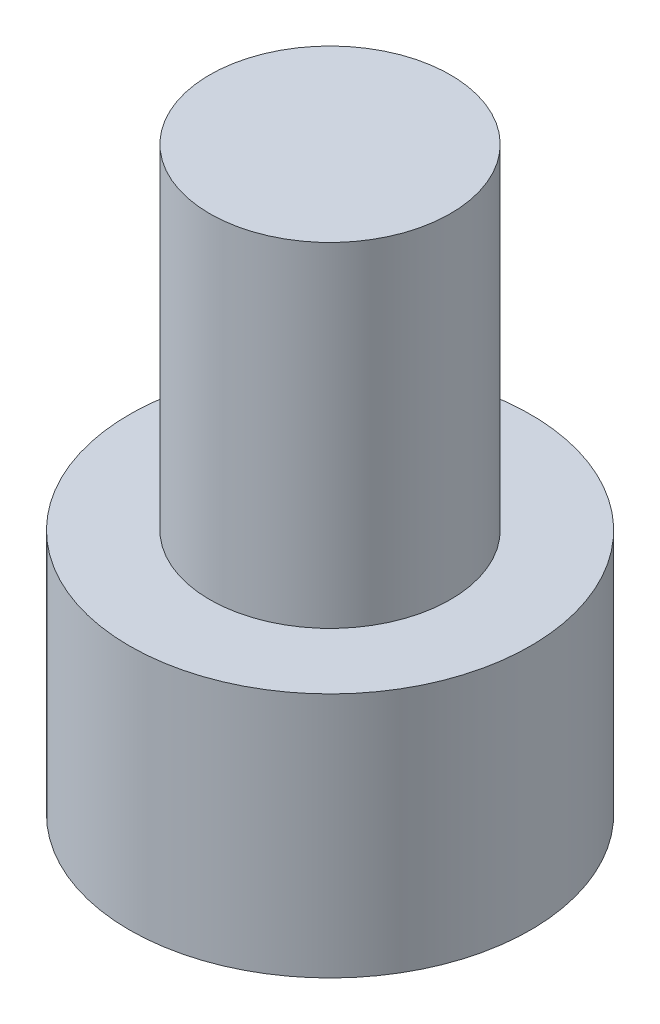
ISO-10303-21;
HEADER;
FILE_DESCRIPTION(('STEP AP214'),'2;1');
FILE_NAME('part.step','',(''),(''),'','','');
FILE_SCHEMA(('AUTOMOTIVE_DESIGN { 1 0 10303 214 1 1 1 1 }'));
ENDSEC;
DATA;
#1=APPLICATION_CONTEXT('core data for automotive mechanical design processes');
#2=APPLICATION_PROTOCOL_DEFINITION('international standard','automotive_design',2000,#1);
#3=PRODUCT_CONTEXT('',#1,'mechanical');
#4=PRODUCT('Part','Part','',(#3));
#5=PRODUCT_RELATED_PRODUCT_CATEGORY('part','',(#4));
#6=PRODUCT_DEFINITION_FORMATION('','',#4);
#7=PRODUCT_DEFINITION_CONTEXT('part definition',#1,'design');
#8=PRODUCT_DEFINITION('design','',#6,#7);
#9=PRODUCT_DEFINITION_SHAPE('','',#8);
#10=(LENGTH_UNIT() NAMED_UNIT(*) SI_UNIT(.MILLI.,.METRE.));
#11=(NAMED_UNIT(*) PLANE_ANGLE_UNIT() SI_UNIT($,.RADIAN.));
#12=(NAMED_UNIT(*) SI_UNIT($,.STERADIAN.) SOLID_ANGLE_UNIT());
#13=UNCERTAINTY_MEASURE_WITH_UNIT(LENGTH_MEASURE(1.E-05),#10,'distance_accuracy_value','');
#14=(GEOMETRIC_REPRESENTATION_CONTEXT(3) GLOBAL_UNCERTAINTY_ASSIGNED_CONTEXT((#13)) GLOBAL_UNIT_ASSIGNED_CONTEXT((#10,
#11,#12)) REPRESENTATION_CONTEXT('',''));
#15=CARTESIAN_POINT('',(0.,0.,0.));
#16=DIRECTION('',(0.,0.,1.));
#17=DIRECTION('',(1.,0.,0.));
#18=AXIS2_PLACEMENT_3D('',#15,#16,#17);
#19=CARTESIAN_POINT('',(0.,3.5052,0.));
#20=DIRECTION('',(0.,1.,0.));
#21=DIRECTION('',(0.,0.,1.));
#22=AXIS2_PLACEMENT_3D('',#19,#20,#21);
#23=PLANE('',#22);
#24=CARTESIAN_POINT('',(0.,3.5052,0.));
#25=DIRECTION('',(0.,1.,0.));
#26=DIRECTION('',(0.,0.,1.));
#27=AXIS2_PLACEMENT_3D('',#24,#25,#26);
#28=CIRCLE('',#27,2.8575);
#29=CARTESIAN_POINT('',(0.,3.5052,2.8575));
#30=VERTEX_POINT('',#29);
#31=EDGE_CURVE('E11',#30,#30,#28,.T.);
#32=ORIENTED_EDGE('',*,*,#31,.T.);
#33=EDGE_LOOP('',(#32));
#34=FACE_BOUND('',#33,.T.);
#35=CARTESIAN_POINT('',(0.,3.5052,0.));
#36=DIRECTION('',(0.,1.,0.));
#37=DIRECTION('',(0.,0.,1.));
#38=AXIS2_PLACEMENT_3D('',#35,#36,#37);
#39=CIRCLE('',#38,1.7145);
#40=CARTESIAN_POINT('',(0.,3.5052,1.7145));
#41=VERTEX_POINT('',#40);
#42=EDGE_CURVE('E152',#41,#41,#39,.T.);
#43=ORIENTED_EDGE('',*,*,#42,.F.);
#44=EDGE_LOOP('',(#43));
#45=FACE_BOUND('',#44,.T.);
#46=ADVANCED_FACE('F33',(#34,#45),#23,.T.);
#47=CARTESIAN_POINT('',(0.,3.5052,0.));
#48=DIRECTION('',(0.,-1.,0.));
#49=DIRECTION('',(0.,0.,-1.));
#50=AXIS2_PLACEMENT_3D('',#47,#48,#49);
#51=CYLINDRICAL_SURFACE('',#50,2.8575);
#52=ORIENTED_EDGE('',*,*,#31,.F.);
#53=EDGE_LOOP('',(#52));
#54=FACE_BOUND('',#53,.T.);
#55=CARTESIAN_POINT('',(0.,0.,0.));
#56=DIRECTION('',(0.,1.,0.));
#57=DIRECTION('',(0.,0.,1.));
#58=AXIS2_PLACEMENT_3D('',#55,#56,#57);
#59=CIRCLE('',#58,2.8575);
#60=CARTESIAN_POINT('',(0.,0.,2.8575));
#61=VERTEX_POINT('',#60);
#62=EDGE_CURVE('E37',#61,#61,#59,.T.);
#63=ORIENTED_EDGE('',*,*,#62,.T.);
#64=EDGE_LOOP('',(#63));
#65=FACE_BOUND('',#64,.T.);
#66=ADVANCED_FACE('F35',(#54,#65),#51,.T.);
#67=CARTESIAN_POINT('',(0.,0.,0.));
#68=DIRECTION('',(0.,1.,0.));
#69=DIRECTION('',(0.,0.,1.));
#70=AXIS2_PLACEMENT_3D('',#67,#68,#69);
#71=PLANE('',#70);
#72=DIRECTION('',(-0.500000000000001,0.,0.866025403784438));
#73=VECTOR('',#72,1.);
#74=CARTESIAN_POINT('',(1.60395121659243,0.,0.));
#75=LINE('',#74,#73);
#76=CARTESIAN_POINT('',(1.60395121659243,0.,0.));
#77=VERTEX_POINT('',#76);
#78=CARTESIAN_POINT('',(0.801975608296214,0.,1.3890625));
#79=VERTEX_POINT('',#78);
#80=EDGE_CURVE('E122',#77,#79,#75,.T.);
#81=ORIENTED_EDGE('',*,*,#80,.F.);
#82=DIRECTION('',(0.5,0.,0.866025403784439));
#83=VECTOR('',#82,1.);
#84=CARTESIAN_POINT('',(0.801975608296215,0.,-1.3890625));
#85=LINE('',#84,#83);
#86=CARTESIAN_POINT('',(0.801975608296215,0.,-1.3890625));
#87=VERTEX_POINT('',#86);
#88=EDGE_CURVE('E48',#87,#77,#85,.T.);
#89=ORIENTED_EDGE('',*,*,#88,.F.);
#90=DIRECTION('',(1.,0.,0.));
#91=VECTOR('',#90,1.);
#92=CARTESIAN_POINT('',(-0.801975608296214,0.,-1.3890625));
#93=LINE('',#92,#91);
#94=CARTESIAN_POINT('',(-0.801975608296214,0.,-1.3890625));
#95=VERTEX_POINT('',#94);
#96=EDGE_CURVE('E132',#95,#87,#93,.T.);
#97=ORIENTED_EDGE('',*,*,#96,.F.);
#98=DIRECTION('',(0.5,0.,-0.866025403784438));
#99=VECTOR('',#98,1.);
#100=CARTESIAN_POINT('',(-1.60395121659243,0.,0.));
#101=LINE('',#100,#99);
#102=CARTESIAN_POINT('',(-1.60395121659243,0.,0.));
#103=VERTEX_POINT('',#102);
#104=EDGE_CURVE('E130',#103,#95,#101,.T.);
#105=ORIENTED_EDGE('',*,*,#104,.F.);
#106=DIRECTION('',(-0.5,0.,-0.866025403784439));
#107=VECTOR('',#106,1.);
#108=CARTESIAN_POINT('',(-0.801975608296214,0.,1.3890625));
#109=LINE('',#108,#107);
#110=CARTESIAN_POINT('',(-0.801975608296214,0.,1.3890625));
#111=VERTEX_POINT('',#110);
#112=EDGE_CURVE('E96',#111,#103,#109,.T.);
#113=ORIENTED_EDGE('',*,*,#112,.F.);
#114=DIRECTION('',(-1.,0.,0.));
#115=VECTOR('',#114,1.);
#116=CARTESIAN_POINT('',(0.801975608296214,0.,1.3890625));
#117=LINE('',#116,#115);
#118=EDGE_CURVE('E126',#79,#111,#117,.T.);
#119=ORIENTED_EDGE('',*,*,#118,.F.);
#120=EDGE_LOOP('',(#81,#89,#97,#105,#113,#119));
#121=FACE_BOUND('',#120,.T.);
#122=ORIENTED_EDGE('',*,*,#62,.F.);
#123=EDGE_LOOP('',(#122));
#124=FACE_BOUND('',#123,.T.);
#125=ADVANCED_FACE('F145',(#121,#124),#71,.F.);
#126=CARTESIAN_POINT('',(0.801975608296215,1.9558,-1.3890625));
#127=DIRECTION('',(0.866025403784438,0.,-0.5));
#128=DIRECTION('',(-0.5,0.,-0.866025403784439));
#129=AXIS2_PLACEMENT_3D('',#126,#127,#128);
#130=PLANE('',#129);
#131=ORIENTED_EDGE('',*,*,#88,.T.);
#132=DIRECTION('',(0.,-1.,0.));
#133=VECTOR('',#132,1.);
#134=CARTESIAN_POINT('',(1.60395121659243,1.9558,0.));
#135=LINE('',#134,#133);
#136=CARTESIAN_POINT('',(1.60395121659243,1.9558,0.));
#137=VERTEX_POINT('',#136);
#138=EDGE_CURVE('E78',#137,#77,#135,.T.);
#139=ORIENTED_EDGE('',*,*,#138,.F.);
#140=DIRECTION('',(0.5,0.,0.866025403784439));
#141=VECTOR('',#140,1.);
#142=CARTESIAN_POINT('',(0.801975608296215,1.9558,-1.3890625));
#143=LINE('',#142,#141);
#144=CARTESIAN_POINT('',(0.801975608296215,1.9558,-1.3890625));
#145=VERTEX_POINT('',#144);
#146=EDGE_CURVE('E134',#145,#137,#143,.T.);
#147=ORIENTED_EDGE('',*,*,#146,.F.);
#148=DIRECTION('',(0.,-1.,0.));
#149=VECTOR('',#148,1.);
#150=CARTESIAN_POINT('',(0.801975608296215,1.9558,-1.3890625));
#151=LINE('',#150,#149);
#152=EDGE_CURVE('E56',#145,#87,#151,.T.);
#153=ORIENTED_EDGE('',*,*,#152,.T.);
#154=EDGE_LOOP('',(#131,#139,#147,#153));
#155=FACE_BOUND('',#154,.T.);
#156=ADVANCED_FACE('F174',(#155),#130,.F.);
#157=CARTESIAN_POINT('',(-0.801975608296214,1.9558,-1.3890625));
#158=DIRECTION('',(0.,0.,-1.));
#159=DIRECTION('',(-1.,0.,0.));
#160=AXIS2_PLACEMENT_3D('',#157,#158,#159);
#161=PLANE('',#160);
#162=ORIENTED_EDGE('',*,*,#96,.T.);
#163=ORIENTED_EDGE('',*,*,#152,.F.);
#164=DIRECTION('',(1.,0.,0.));
#165=VECTOR('',#164,1.);
#166=CARTESIAN_POINT('',(-0.801975608296214,1.9558,-1.3890625));
#167=LINE('',#166,#165);
#168=CARTESIAN_POINT('',(-0.801975608296214,1.9558,-1.3890625));
#169=VERTEX_POINT('',#168);
#170=EDGE_CURVE('E108',#169,#145,#167,.T.);
#171=ORIENTED_EDGE('',*,*,#170,.F.);
#172=DIRECTION('',(0.,-1.,0.));
#173=VECTOR('',#172,1.);
#174=CARTESIAN_POINT('',(-0.801975608296214,1.9558,-1.3890625));
#175=LINE('',#174,#173);
#176=EDGE_CURVE('E100',#169,#95,#175,.T.);
#177=ORIENTED_EDGE('',*,*,#176,.T.);
#178=EDGE_LOOP('',(#162,#163,#171,#177));
#179=FACE_BOUND('',#178,.T.);
#180=ADVANCED_FACE('F180',(#179),#161,.F.);
#181=CARTESIAN_POINT('',(-1.60395121659243,1.9558,0.));
#182=DIRECTION('',(-0.866025403784438,0.,-0.5));
#183=DIRECTION('',(-0.5,0.,0.866025403784439));
#184=AXIS2_PLACEMENT_3D('',#181,#182,#183);
#185=PLANE('',#184);
#186=ORIENTED_EDGE('',*,*,#104,.T.);
#187=ORIENTED_EDGE('',*,*,#176,.F.);
#188=DIRECTION('',(0.5,0.,-0.866025403784438));
#189=VECTOR('',#188,1.);
#190=CARTESIAN_POINT('',(-1.60395121659243,1.9558,0.));
#191=LINE('',#190,#189);
#192=CARTESIAN_POINT('',(-1.60395121659243,1.9558,0.));
#193=VERTEX_POINT('',#192);
#194=EDGE_CURVE('E104',#193,#169,#191,.T.);
#195=ORIENTED_EDGE('',*,*,#194,.F.);
#196=DIRECTION('',(0.,-1.,0.));
#197=VECTOR('',#196,1.);
#198=CARTESIAN_POINT('',(-1.60395121659243,1.9558,0.));
#199=LINE('',#198,#197);
#200=EDGE_CURVE('E89',#193,#103,#199,.T.);
#201=ORIENTED_EDGE('',*,*,#200,.T.);
#202=EDGE_LOOP('',(#186,#187,#195,#201));
#203=FACE_BOUND('',#202,.T.);
#204=ADVANCED_FACE('F105',(#203),#185,.F.);
#205=CARTESIAN_POINT('',(-0.801975608296214,1.9558,1.3890625));
#206=DIRECTION('',(-0.866025403784439,0.,0.5));
#207=DIRECTION('',(0.5,0.,0.866025403784439));
#208=AXIS2_PLACEMENT_3D('',#205,#206,#207);
#209=PLANE('',#208);
#210=ORIENTED_EDGE('',*,*,#112,.T.);
#211=ORIENTED_EDGE('',*,*,#200,.F.);
#212=DIRECTION('',(-0.5,0.,-0.866025403784439));
#213=VECTOR('',#212,1.);
#214=CARTESIAN_POINT('',(-0.801975608296214,1.9558,1.3890625));
#215=LINE('',#214,#213);
#216=CARTESIAN_POINT('',(-0.801975608296214,1.9558,1.3890625));
#217=VERTEX_POINT('',#216);
#218=EDGE_CURVE('E93',#217,#193,#215,.T.);
#219=ORIENTED_EDGE('',*,*,#218,.F.);
#220=DIRECTION('',(0.,-1.,0.));
#221=VECTOR('',#220,1.);
#222=CARTESIAN_POINT('',(-0.801975608296214,1.9558,1.3890625));
#223=LINE('',#222,#221);
#224=EDGE_CURVE('E101',#217,#111,#223,.T.);
#225=ORIENTED_EDGE('',*,*,#224,.T.);
#226=EDGE_LOOP('',(#210,#211,#219,#225));
#227=FACE_BOUND('',#226,.T.);
#228=ADVANCED_FACE('F91',(#227),#209,.F.);
#229=CARTESIAN_POINT('',(0.801975608296214,1.9558,1.3890625));
#230=DIRECTION('',(0.,0.,1.));
#231=DIRECTION('',(1.,0.,0.));
#232=AXIS2_PLACEMENT_3D('',#229,#230,#231);
#233=PLANE('',#232);
#234=ORIENTED_EDGE('',*,*,#118,.T.);
#235=ORIENTED_EDGE('',*,*,#224,.F.);
#236=DIRECTION('',(-1.,0.,0.));
#237=VECTOR('',#236,1.);
#238=CARTESIAN_POINT('',(0.801975608296214,1.9558,1.3890625));
#239=LINE('',#238,#237);
#240=CARTESIAN_POINT('',(0.801975608296214,1.9558,1.3890625));
#241=VERTEX_POINT('',#240);
#242=EDGE_CURVE('E114',#241,#217,#239,.T.);
#243=ORIENTED_EDGE('',*,*,#242,.F.);
#244=DIRECTION('',(0.,-1.,0.));
#245=VECTOR('',#244,1.);
#246=CARTESIAN_POINT('',(0.801975608296214,1.9558,1.3890625));
#247=LINE('',#246,#245);
#248=EDGE_CURVE('E138',#241,#79,#247,.T.);
#249=ORIENTED_EDGE('',*,*,#248,.T.);
#250=EDGE_LOOP('',(#234,#235,#243,#249));
#251=FACE_BOUND('',#250,.T.);
#252=ADVANCED_FACE('F149',(#251),#233,.F.);
#253=CARTESIAN_POINT('',(1.60395121659243,1.9558,0.));
#254=DIRECTION('',(0.866025403784438,0.,0.500000000000001));
#255=DIRECTION('',(0.500000000000001,0.,-0.866025403784438));
#256=AXIS2_PLACEMENT_3D('',#253,#254,#255);
#257=PLANE('',#256);
#258=ORIENTED_EDGE('',*,*,#80,.T.);
#259=ORIENTED_EDGE('',*,*,#248,.F.);
#260=DIRECTION('',(-0.500000000000001,0.,0.866025403784438));
#261=VECTOR('',#260,1.);
#262=CARTESIAN_POINT('',(1.60395121659243,1.9558,0.));
#263=LINE('',#262,#261);
#264=EDGE_CURVE('E116',#137,#241,#263,.T.);
#265=ORIENTED_EDGE('',*,*,#264,.F.);
#266=ORIENTED_EDGE('',*,*,#138,.T.);
#267=EDGE_LOOP('',(#258,#259,#265,#266));
#268=FACE_BOUND('',#267,.T.);
#269=ADVANCED_FACE('F142',(#268),#257,.F.);
#270=CARTESIAN_POINT('',(0.,1.9558,0.));
#271=DIRECTION('',(0.,-1.,0.));
#272=DIRECTION('',(0.,0.,-1.));
#273=AXIS2_PLACEMENT_3D('',#270,#271,#272);
#274=PLANE('',#273);
#275=ORIENTED_EDGE('',*,*,#146,.T.);
#276=ORIENTED_EDGE('',*,*,#264,.T.);
#277=ORIENTED_EDGE('',*,*,#242,.T.);
#278=ORIENTED_EDGE('',*,*,#218,.T.);
#279=ORIENTED_EDGE('',*,*,#194,.T.);
#280=ORIENTED_EDGE('',*,*,#170,.T.);
#281=EDGE_LOOP('',(#275,#276,#277,#278,#279,#280));
#282=FACE_BOUND('',#281,.T.);
#283=ADVANCED_FACE('F111',(#282),#274,.T.);
#284=CARTESIAN_POINT('',(0.,8.2677,0.));
#285=DIRECTION('',(0.,-1.,0.));
#286=DIRECTION('',(0.,0.,-1.));
#287=AXIS2_PLACEMENT_3D('',#284,#285,#286);
#288=CYLINDRICAL_SURFACE('',#287,1.7145);
#289=CARTESIAN_POINT('',(0.,8.2677,0.));
#290=DIRECTION('',(0.,1.,0.));
#291=DIRECTION('',(0.,0.,1.));
#292=AXIS2_PLACEMENT_3D('',#289,#290,#291);
#293=CIRCLE('',#292,1.7145);
#294=CARTESIAN_POINT('',(0.,8.2677,1.7145));
#295=VERTEX_POINT('',#294);
#296=EDGE_CURVE('E123',#295,#295,#293,.T.);
#297=ORIENTED_EDGE('',*,*,#296,.F.);
#298=EDGE_LOOP('',(#297));
#299=FACE_BOUND('',#298,.T.);
#300=ORIENTED_EDGE('',*,*,#42,.T.);
#301=EDGE_LOOP('',(#300));
#302=FACE_BOUND('',#301,.T.);
#303=ADVANCED_FACE('F160',(#299,#302),#288,.T.);
#304=CARTESIAN_POINT('',(0.,8.2677,0.));
#305=DIRECTION('',(0.,1.,0.));
#306=DIRECTION('',(0.,0.,1.));
#307=AXIS2_PLACEMENT_3D('',#304,#305,#306);
#308=PLANE('',#307);
#309=ORIENTED_EDGE('',*,*,#296,.T.);
#310=EDGE_LOOP('',(#309));
#311=FACE_BOUND('',#310,.T.);
#312=ADVANCED_FACE('F158',(#311),#308,.T.);
#313=CLOSED_SHELL('',(#46,#66,#125,#156,#180,#204,#228,#252,#269,#283,#303,#312));
#314=MANIFOLD_SOLID_BREP('B2',#313);
#315=ADVANCED_BREP_SHAPE_REPRESENTATION('',(#18,#314),#14);
#316=SHAPE_DEFINITION_REPRESENTATION(#9,#315);
ENDSEC;
END-ISO-10303-21;
